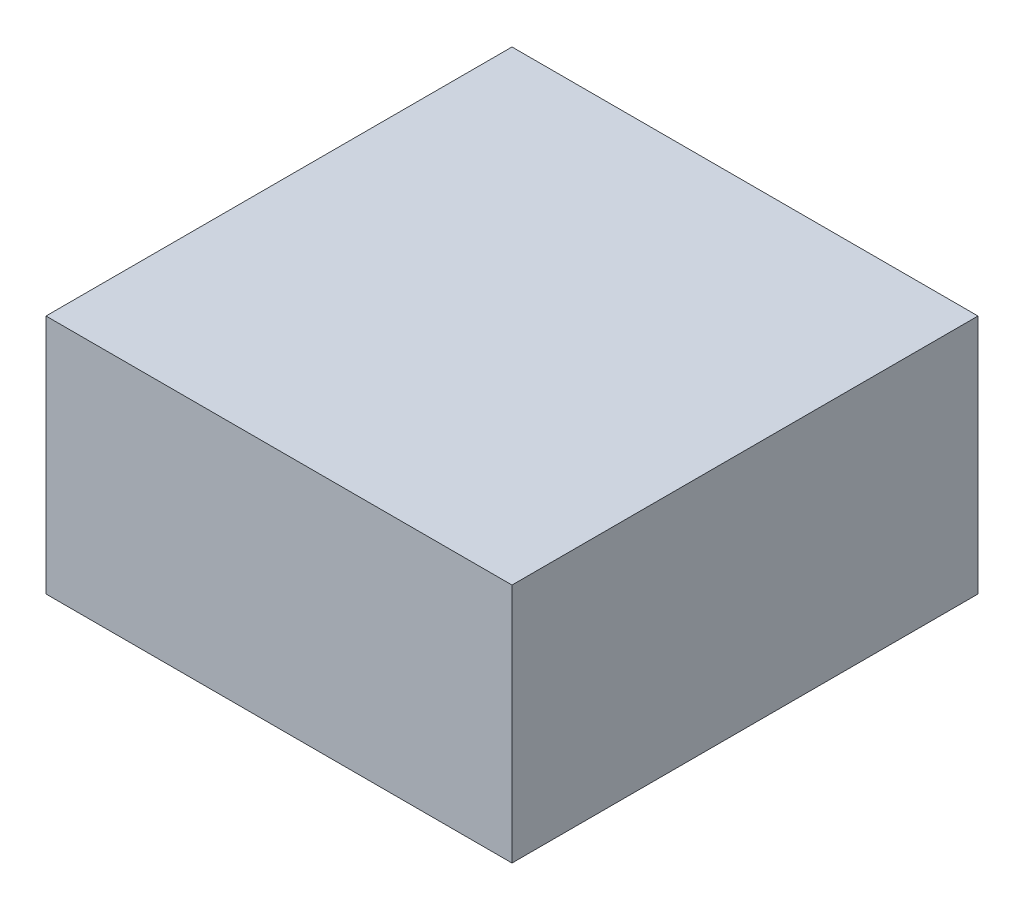
ISO-10303-21;
HEADER;
FILE_DESCRIPTION(('STEP AP214'),'2;1');
FILE_NAME('part.step','',(''),(''),'','','');
FILE_SCHEMA(('AUTOMOTIVE_DESIGN { 1 0 10303 214 1 1 1 1 }'));
ENDSEC;
DATA;
#1=APPLICATION_CONTEXT('core data for automotive mechanical design processes');
#2=APPLICATION_PROTOCOL_DEFINITION('international standard','automotive_design',2000,#1);
#3=PRODUCT_CONTEXT('',#1,'mechanical');
#4=PRODUCT('Part','Part','',(#3));
#5=PRODUCT_RELATED_PRODUCT_CATEGORY('part','',(#4));
#6=PRODUCT_DEFINITION_FORMATION('','',#4);
#7=PRODUCT_DEFINITION_CONTEXT('part definition',#1,'design');
#8=PRODUCT_DEFINITION('design','',#6,#7);
#9=PRODUCT_DEFINITION_SHAPE('','',#8);
#10=(LENGTH_UNIT() NAMED_UNIT(*) SI_UNIT(.MILLI.,.METRE.));
#11=(NAMED_UNIT(*) PLANE_ANGLE_UNIT() SI_UNIT($,.RADIAN.));
#12=(NAMED_UNIT(*) SI_UNIT($,.STERADIAN.) SOLID_ANGLE_UNIT());
#13=UNCERTAINTY_MEASURE_WITH_UNIT(LENGTH_MEASURE(1.E-05),#10,'distance_accuracy_value','');
#14=(GEOMETRIC_REPRESENTATION_CONTEXT(3) GLOBAL_UNCERTAINTY_ASSIGNED_CONTEXT((#13)) GLOBAL_UNIT_ASSIGNED_CONTEXT((#10,
#11,#12)) REPRESENTATION_CONTEXT('',''));
#15=CARTESIAN_POINT('',(0.,0.,0.));
#16=DIRECTION('',(0.,0.,1.));
#17=DIRECTION('',(1.,0.,0.));
#18=AXIS2_PLACEMENT_3D('',#15,#16,#17);
#19=CARTESIAN_POINT('',(-72.08658338126,-2.126384400525,-44.48106509227));
#20=DIRECTION('',(0.,1.,0.));
#21=DIRECTION('',(0.,0.,1.));
#22=AXIS2_PLACEMENT_3D('',#19,#20,#21);
#23=PLANE('',#22);
#24=DIRECTION('',(0.,0.,1.));
#25=VECTOR('',#24,1.);
#26=CARTESIAN_POINT('',(-69.4949936611,-2.126384400555,-46.32331973764));
#27=LINE('',#26,#25);
#28=CARTESIAN_POINT('',(-69.4949936611,-2.1263844005475,-46.32331973764));
#29=VERTEX_POINT('',#28);
#30=CARTESIAN_POINT('',(-69.4949936611,-2.1263844005545,-46.62331973764));
#31=VERTEX_POINT('',#30);
#32=EDGE_CURVE('E67',#29,#31,#27,.F.);
#33=ORIENTED_EDGE('',*,*,#32,.T.);
#34=DIRECTION('',(1.,0.,0.));
#35=VECTOR('',#34,1.);
#36=CARTESIAN_POINT('',(-69.6449936611,-2.126384400569,-46.62331973764));
#37=LINE('',#36,#35);
#38=CARTESIAN_POINT('',(-69.7949936611,-2.1263844005445,-46.62331973764));
#39=VERTEX_POINT('',#38);
#40=EDGE_CURVE('E54',#31,#39,#37,.F.);
#41=ORIENTED_EDGE('',*,*,#40,.T.);
#42=DIRECTION('',(0.,0.,1.));
#43=VECTOR('',#42,1.);
#44=CARTESIAN_POINT('',(-69.7949936611,-2.126384400542,-46.32331973764));
#45=LINE('',#44,#43);
#46=CARTESIAN_POINT('',(-69.7949936611,-2.12638440053675,-46.32331973764));
#47=VERTEX_POINT('',#46);
#48=EDGE_CURVE('E19',#47,#39,#45,.F.);
#49=ORIENTED_EDGE('',*,*,#48,.F.);
#50=DIRECTION('',(1.,0.,0.));
#51=VECTOR('',#50,1.);
#52=CARTESIAN_POINT('',(-69.6449936611,-2.126384400555,-46.32331973764));
#53=LINE('',#52,#51);
#54=EDGE_CURVE('E79',#29,#47,#53,.F.);
#55=ORIENTED_EDGE('',*,*,#54,.F.);
#56=EDGE_LOOP('',(#33,#41,#49,#55));
#57=FACE_BOUND('',#56,.T.);
#58=ADVANCED_FACE('F16',(#57),#23,.T.);
#59=CARTESIAN_POINT('',(-69.7949936611,-2.216384400507,-46.32331973764));
#60=DIRECTION('',(-1.,0.,0.));
#61=DIRECTION('',(0.,0.,1.));
#62=AXIS2_PLACEMENT_3D('',#59,#60,#61);
#63=PLANE('',#62);
#64=ORIENTED_EDGE('',*,*,#48,.T.);
#65=DIRECTION('',(0.,1.,0.));
#66=VECTOR('',#65,1.);
#67=CARTESIAN_POINT('',(-69.7949936611,-2.216384400507,-46.62331973764));
#68=LINE('',#67,#66);
#69=CARTESIAN_POINT('',(-69.7949936611,-2.281384400507,-46.62331973764));
#70=VERTEX_POINT('',#69);
#71=EDGE_CURVE('E60',#39,#70,#68,.F.);
#72=ORIENTED_EDGE('',*,*,#71,.T.);
#73=DIRECTION('',(0.,0.,-1.));
#74=VECTOR('',#73,1.);
#75=CARTESIAN_POINT('',(-69.7949936611,-2.281384400507,-46.32331973764));
#76=LINE('',#75,#74);
#77=CARTESIAN_POINT('',(-69.7949936611,-2.281384400507,-46.32331973764));
#78=VERTEX_POINT('',#77);
#79=EDGE_CURVE('E82',#78,#70,#76,.T.);
#80=ORIENTED_EDGE('',*,*,#79,.F.);
#81=DIRECTION('',(0.,1.,0.));
#82=VECTOR('',#81,1.);
#83=CARTESIAN_POINT('',(-69.7949936611,-2.216384400507,-46.32331973764));
#84=LINE('',#83,#82);
#85=EDGE_CURVE('E63',#47,#78,#84,.F.);
#86=ORIENTED_EDGE('',*,*,#85,.F.);
#87=EDGE_LOOP('',(#64,#72,#80,#86));
#88=FACE_BOUND('',#87,.T.);
#89=ADVANCED_FACE('F59',(#88),#63,.T.);
#90=CARTESIAN_POINT('',(-69.6449936611,-2.216384400507,-46.62331973764));
#91=DIRECTION('',(0.,0.,1.));
#92=DIRECTION('',(1.,0.,0.));
#93=AXIS2_PLACEMENT_3D('',#90,#91,#92);
#94=PLANE('',#93);
#95=DIRECTION('',(0.,1.,0.));
#96=VECTOR('',#95,1.);
#97=CARTESIAN_POINT('',(-69.4949936611,-2.216384400507,-46.62331973764));
#98=LINE('',#97,#96);
#99=CARTESIAN_POINT('',(-69.4949936611,-2.281384400507,-46.62331973764));
#100=VERTEX_POINT('',#99);
#101=EDGE_CURVE('E69',#31,#100,#98,.F.);
#102=ORIENTED_EDGE('',*,*,#101,.T.);
#103=DIRECTION('',(1.,0.,0.));
#104=VECTOR('',#103,1.);
#105=CARTESIAN_POINT('',(-69.6449936611,-2.281384400507,-46.62331973764));
#106=LINE('',#105,#104);
#107=EDGE_CURVE('E73',#70,#100,#106,.T.);
#108=ORIENTED_EDGE('',*,*,#107,.F.);
#109=ORIENTED_EDGE('',*,*,#71,.F.);
#110=ORIENTED_EDGE('',*,*,#40,.F.);
#111=EDGE_LOOP('',(#102,#108,#109,#110));
#112=FACE_BOUND('',#111,.T.);
#113=ADVANCED_FACE('F71',(#112),#94,.F.);
#114=CARTESIAN_POINT('',(-69.4949936611,-2.216384400507,-46.32331973764));
#115=DIRECTION('',(-1.,0.,0.));
#116=DIRECTION('',(0.,0.,1.));
#117=AXIS2_PLACEMENT_3D('',#114,#115,#116);
#118=PLANE('',#117);
#119=DIRECTION('',(0.,1.,0.));
#120=VECTOR('',#119,1.);
#121=CARTESIAN_POINT('',(-69.4949936611,-2.216384400507,-46.32331973764));
#122=LINE('',#121,#120);
#123=CARTESIAN_POINT('',(-69.4949936611,-2.281384400507,-46.32331973764));
#124=VERTEX_POINT('',#123);
#125=EDGE_CURVE('E34',#124,#29,#122,.T.);
#126=ORIENTED_EDGE('',*,*,#125,.F.);
#127=DIRECTION('',(0.,0.,-1.));
#128=VECTOR('',#127,1.);
#129=CARTESIAN_POINT('',(-69.4949936611,-2.281384400507,-46.32331973764));
#130=LINE('',#129,#128);
#131=EDGE_CURVE('E25',#100,#124,#130,.F.);
#132=ORIENTED_EDGE('',*,*,#131,.F.);
#133=ORIENTED_EDGE('',*,*,#101,.F.);
#134=ORIENTED_EDGE('',*,*,#32,.F.);
#135=EDGE_LOOP('',(#126,#132,#133,#134));
#136=FACE_BOUND('',#135,.T.);
#137=ADVANCED_FACE('F88',(#136),#118,.F.);
#138=CARTESIAN_POINT('',(-69.6449936611,-2.216384400507,-46.32331973764));
#139=DIRECTION('',(0.,0.,1.));
#140=DIRECTION('',(1.,0.,0.));
#141=AXIS2_PLACEMENT_3D('',#138,#139,#140);
#142=PLANE('',#141);
#143=ORIENTED_EDGE('',*,*,#54,.T.);
#144=ORIENTED_EDGE('',*,*,#85,.T.);
#145=DIRECTION('',(1.,0.,0.));
#146=VECTOR('',#145,1.);
#147=CARTESIAN_POINT('',(-69.6449936611,-2.281384400507,-46.32331973764));
#148=LINE('',#147,#146);
#149=EDGE_CURVE('E11',#124,#78,#148,.F.);
#150=ORIENTED_EDGE('',*,*,#149,.F.);
#151=ORIENTED_EDGE('',*,*,#125,.T.);
#152=EDGE_LOOP('',(#143,#144,#150,#151));
#153=FACE_BOUND('',#152,.T.);
#154=ADVANCED_FACE('F90',(#153),#142,.T.);
#155=CARTESIAN_POINT('',(-69.6449936611,-2.281384400507,-46.32331973764));
#156=DIRECTION('',(0.,-1.,0.));
#157=DIRECTION('',(0.,0.,-1.));
#158=AXIS2_PLACEMENT_3D('',#155,#156,#157);
#159=PLANE('',#158);
#160=ORIENTED_EDGE('',*,*,#131,.T.);
#161=ORIENTED_EDGE('',*,*,#149,.T.);
#162=ORIENTED_EDGE('',*,*,#79,.T.);
#163=ORIENTED_EDGE('',*,*,#107,.T.);
#164=EDGE_LOOP('',(#160,#161,#162,#163));
#165=FACE_BOUND('',#164,.T.);
#166=ADVANCED_FACE('F87',(#165),#159,.T.);
#167=CLOSED_SHELL('',(#58,#89,#113,#137,#154,#166));
#168=MANIFOLD_SOLID_BREP('B1',#167);
#169=ADVANCED_BREP_SHAPE_REPRESENTATION('',(#18,#168),#14);
#170=SHAPE_DEFINITION_REPRESENTATION(#9,#169);
ENDSEC;
END-ISO-10303-21;
